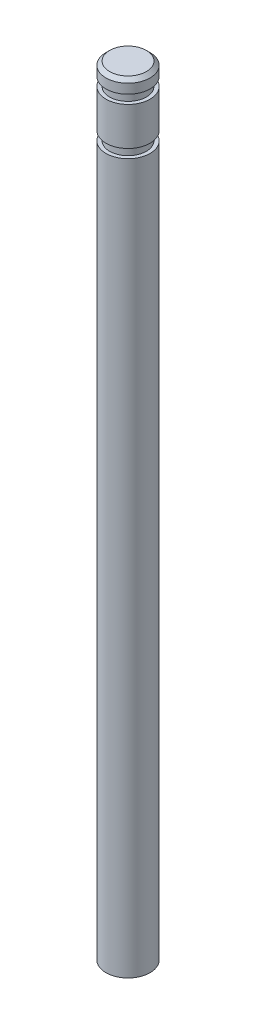
ISO-10303-21;
HEADER;
FILE_DESCRIPTION(('STEP AP214'),'2;1');
FILE_NAME('part.step','',(''),(''),'','','');
FILE_SCHEMA(('AUTOMOTIVE_DESIGN { 1 0 10303 214 1 1 1 1 }'));
ENDSEC;
DATA;
#1=APPLICATION_CONTEXT('core data for automotive mechanical design processes');
#2=APPLICATION_PROTOCOL_DEFINITION('international standard','automotive_design',2000,#1);
#3=PRODUCT_CONTEXT('',#1,'mechanical');
#4=PRODUCT('Part','Part','',(#3));
#5=PRODUCT_RELATED_PRODUCT_CATEGORY('part','',(#4));
#6=PRODUCT_DEFINITION_FORMATION('','',#4);
#7=PRODUCT_DEFINITION_CONTEXT('part definition',#1,'design');
#8=PRODUCT_DEFINITION('design','',#6,#7);
#9=PRODUCT_DEFINITION_SHAPE('','',#8);
#10=(LENGTH_UNIT() NAMED_UNIT(*) SI_UNIT(.MILLI.,.METRE.));
#11=(NAMED_UNIT(*) PLANE_ANGLE_UNIT() SI_UNIT($,.RADIAN.));
#12=(NAMED_UNIT(*) SI_UNIT($,.STERADIAN.) SOLID_ANGLE_UNIT());
#13=UNCERTAINTY_MEASURE_WITH_UNIT(LENGTH_MEASURE(1.E-05),#10,'distance_accuracy_value','');
#14=(GEOMETRIC_REPRESENTATION_CONTEXT(3) GLOBAL_UNCERTAINTY_ASSIGNED_CONTEXT((#13)) GLOBAL_UNIT_ASSIGNED_CONTEXT((#10,
#11,#12)) REPRESENTATION_CONTEXT('',''));
#15=CARTESIAN_POINT('',(0.,0.,0.));
#16=DIRECTION('',(0.,0.,1.));
#17=DIRECTION('',(1.,0.,0.));
#18=AXIS2_PLACEMENT_3D('',#15,#16,#17);
#19=CARTESIAN_POINT('',(0.,53.,0.));
#20=DIRECTION('',(0.,-1.,0.));
#21=DIRECTION('',(0.,0.,-1.));
#22=AXIS2_PLACEMENT_3D('',#19,#20,#21);
#23=CYLINDRICAL_SURFACE('',#22,1.5);
#24=CARTESIAN_POINT('',(0.,48.9,0.));
#25=DIRECTION('',(0.,-1.,0.));
#26=DIRECTION('',(0.,0.,-1.));
#27=AXIS2_PLACEMENT_3D('',#24,#25,#26);
#28=CIRCLE('',#27,1.5);
#29=CARTESIAN_POINT('',(0.,48.9,-1.5));
#30=VERTEX_POINT('',#29);
#31=EDGE_CURVE('E52',#30,#30,#28,.T.);
#32=ORIENTED_EDGE('',*,*,#31,.F.);
#33=EDGE_LOOP('',(#32));
#34=FACE_BOUND('',#33,.T.);
#35=CARTESIAN_POINT('',(0.,51.5,0.));
#36=DIRECTION('',(0.,-1.,0.));
#37=DIRECTION('',(0.,0.,-1.));
#38=AXIS2_PLACEMENT_3D('',#35,#36,#37);
#39=CIRCLE('',#38,1.5);
#40=CARTESIAN_POINT('',(0.,51.5,-1.5));
#41=VERTEX_POINT('',#40);
#42=EDGE_CURVE('E29',#41,#41,#39,.T.);
#43=ORIENTED_EDGE('',*,*,#42,.T.);
#44=EDGE_LOOP('',(#43));
#45=FACE_BOUND('',#44,.T.);
#46=ADVANCED_FACE('F14',(#34,#45),#23,.T.);
#47=CARTESIAN_POINT('',(1.5,51.5,0.));
#48=DIRECTION('',(0.,-1.,0.));
#49=DIRECTION('',(0.,0.,-1.));
#50=AXIS2_PLACEMENT_3D('',#47,#48,#49);
#51=PLANE('',#50);
#52=ORIENTED_EDGE('',*,*,#42,.F.);
#53=EDGE_LOOP('',(#52));
#54=FACE_BOUND('',#53,.T.);
#55=CARTESIAN_POINT('',(0.,51.5,0.));
#56=DIRECTION('',(0.,-1.,0.));
#57=DIRECTION('',(0.,0.,-1.));
#58=AXIS2_PLACEMENT_3D('',#55,#56,#57);
#59=CIRCLE('',#58,1.25);
#60=CARTESIAN_POINT('',(0.,51.5,-1.25));
#61=VERTEX_POINT('',#60);
#62=EDGE_CURVE('E34',#61,#61,#59,.T.);
#63=ORIENTED_EDGE('',*,*,#62,.T.);
#64=EDGE_LOOP('',(#63));
#65=FACE_BOUND('',#64,.T.);
#66=ADVANCED_FACE('F60',(#54,#65),#51,.F.);
#67=CARTESIAN_POINT('',(0.,0.,0.));
#68=DIRECTION('',(0.,-1.,0.));
#69=DIRECTION('',(0.,0.,-1.));
#70=AXIS2_PLACEMENT_3D('',#67,#68,#69);
#71=CYLINDRICAL_SURFACE('',#70,1.25);
#72=ORIENTED_EDGE('',*,*,#62,.F.);
#73=EDGE_LOOP('',(#72));
#74=FACE_BOUND('',#73,.T.);
#75=CARTESIAN_POINT('',(0.,52.1,0.));
#76=DIRECTION('',(0.,-1.,0.));
#77=DIRECTION('',(0.,0.,-1.));
#78=AXIS2_PLACEMENT_3D('',#75,#76,#77);
#79=CIRCLE('',#78,1.25);
#80=CARTESIAN_POINT('',(0.,52.1,-1.25));
#81=VERTEX_POINT('',#80);
#82=EDGE_CURVE('E37',#81,#81,#79,.T.);
#83=ORIENTED_EDGE('',*,*,#82,.T.);
#84=EDGE_LOOP('',(#83));
#85=FACE_BOUND('',#84,.T.);
#86=ADVANCED_FACE('F67',(#74,#85),#71,.T.);
#87=CARTESIAN_POINT('',(1.5,52.1,0.));
#88=DIRECTION('',(0.,1.,0.));
#89=DIRECTION('',(0.,0.,1.));
#90=AXIS2_PLACEMENT_3D('',#87,#88,#89);
#91=PLANE('',#90);
#92=ORIENTED_EDGE('',*,*,#82,.F.);
#93=EDGE_LOOP('',(#92));
#94=FACE_BOUND('',#93,.T.);
#95=CARTESIAN_POINT('',(0.,52.1,0.));
#96=DIRECTION('',(0.,-1.,0.));
#97=DIRECTION('',(0.,0.,-1.));
#98=AXIS2_PLACEMENT_3D('',#95,#96,#97);
#99=CIRCLE('',#98,1.5);
#100=CARTESIAN_POINT('',(0.,52.1,-1.5));
#101=VERTEX_POINT('',#100);
#102=EDGE_CURVE('E40',#101,#101,#99,.T.);
#103=ORIENTED_EDGE('',*,*,#102,.T.);
#104=EDGE_LOOP('',(#103));
#105=FACE_BOUND('',#104,.T.);
#106=ADVANCED_FACE('F73',(#94,#105),#91,.F.);
#107=CARTESIAN_POINT('',(0.,53.,0.));
#108=DIRECTION('',(0.,1.,0.));
#109=DIRECTION('',(0.,0.,1.));
#110=AXIS2_PLACEMENT_3D('',#107,#108,#109);
#111=PLANE('',#110);
#112=CARTESIAN_POINT('',(0.,53.,0.));
#113=DIRECTION('',(0.,1.,0.));
#114=DIRECTION('',(0.,0.,1.));
#115=AXIS2_PLACEMENT_3D('',#112,#113,#114);
#116=CIRCLE('',#115,1.25);
#117=CARTESIAN_POINT('',(0.,53.,1.25));
#118=VERTEX_POINT('',#117);
#119=EDGE_CURVE('E21',#118,#118,#116,.T.);
#120=ORIENTED_EDGE('',*,*,#119,.T.);
#121=EDGE_LOOP('',(#120));
#122=FACE_BOUND('',#121,.T.);
#123=ADVANCED_FACE('F79',(#122),#111,.T.);
#124=CARTESIAN_POINT('',(0.,52.75,0.));
#125=DIRECTION('',(0.,1.,0.));
#126=DIRECTION('',(0.,0.,1.));
#127=AXIS2_PLACEMENT_3D('',#124,#125,#126);
#128=CIRCLE('',#127,1.5);
#129=CARTESIAN_POINT('',(0.,52.75,1.5));
#130=VERTEX_POINT('',#129);
#131=EDGE_CURVE('E10',#130,#130,#128,.F.);
#132=ORIENTED_EDGE('',*,*,#131,.T.);
#133=EDGE_LOOP('',(#132));
#134=FACE_BOUND('',#133,.T.);
#135=ORIENTED_EDGE('',*,*,#102,.F.);
#136=EDGE_LOOP('',(#135));
#137=FACE_BOUND('',#136,.T.);
#138=ADVANCED_FACE('F61',(#134,#137),#23,.T.);
#139=CARTESIAN_POINT('',(1.5,48.3,0.));
#140=DIRECTION('',(0.,-1.,0.));
#141=DIRECTION('',(0.,0.,-1.));
#142=AXIS2_PLACEMENT_3D('',#139,#140,#141);
#143=PLANE('',#142);
#144=CARTESIAN_POINT('',(0.,48.3,0.));
#145=DIRECTION('',(0.,-1.,0.));
#146=DIRECTION('',(0.,0.,-1.));
#147=AXIS2_PLACEMENT_3D('',#144,#145,#146);
#148=CIRCLE('',#147,1.5);
#149=CARTESIAN_POINT('',(0.,48.3,-1.5));
#150=VERTEX_POINT('',#149);
#151=EDGE_CURVE('E43',#150,#150,#148,.T.);
#152=ORIENTED_EDGE('',*,*,#151,.F.);
#153=EDGE_LOOP('',(#152));
#154=FACE_BOUND('',#153,.T.);
#155=CARTESIAN_POINT('',(0.,48.3,0.));
#156=DIRECTION('',(0.,-1.,0.));
#157=DIRECTION('',(0.,0.,-1.));
#158=AXIS2_PLACEMENT_3D('',#155,#156,#157);
#159=CIRCLE('',#158,1.25);
#160=CARTESIAN_POINT('',(0.,48.3,-1.25));
#161=VERTEX_POINT('',#160);
#162=EDGE_CURVE('E46',#161,#161,#159,.T.);
#163=ORIENTED_EDGE('',*,*,#162,.T.);
#164=EDGE_LOOP('',(#163));
#165=FACE_BOUND('',#164,.T.);
#166=ADVANCED_FACE('F84',(#154,#165),#143,.F.);
#167=CARTESIAN_POINT('',(0.,0.,0.));
#168=DIRECTION('',(0.,-1.,0.));
#169=DIRECTION('',(0.,0.,-1.));
#170=AXIS2_PLACEMENT_3D('',#167,#168,#169);
#171=CYLINDRICAL_SURFACE('',#170,1.25);
#172=ORIENTED_EDGE('',*,*,#162,.F.);
#173=EDGE_LOOP('',(#172));
#174=FACE_BOUND('',#173,.T.);
#175=CARTESIAN_POINT('',(0.,48.9,0.));
#176=DIRECTION('',(0.,-1.,0.));
#177=DIRECTION('',(0.,0.,-1.));
#178=AXIS2_PLACEMENT_3D('',#175,#176,#177);
#179=CIRCLE('',#178,1.25);
#180=CARTESIAN_POINT('',(0.,48.9,-1.25));
#181=VERTEX_POINT('',#180);
#182=EDGE_CURVE('E49',#181,#181,#179,.T.);
#183=ORIENTED_EDGE('',*,*,#182,.T.);
#184=EDGE_LOOP('',(#183));
#185=FACE_BOUND('',#184,.T.);
#186=ADVANCED_FACE('F90',(#174,#185),#171,.T.);
#187=CARTESIAN_POINT('',(1.5,48.9,0.));
#188=DIRECTION('',(0.,1.,0.));
#189=DIRECTION('',(0.,0.,1.));
#190=AXIS2_PLACEMENT_3D('',#187,#188,#189);
#191=PLANE('',#190);
#192=ORIENTED_EDGE('',*,*,#182,.F.);
#193=EDGE_LOOP('',(#192));
#194=FACE_BOUND('',#193,.T.);
#195=ORIENTED_EDGE('',*,*,#31,.T.);
#196=EDGE_LOOP('',(#195));
#197=FACE_BOUND('',#196,.T.);
#198=ADVANCED_FACE('F56',(#194,#197),#191,.F.);
#199=CARTESIAN_POINT('',(0.,0.,0.));
#200=DIRECTION('',(0.,1.,0.));
#201=DIRECTION('',(0.,0.,1.));
#202=AXIS2_PLACEMENT_3D('',#199,#200,#201);
#203=PLANE('',#202);
#204=CARTESIAN_POINT('',(0.,0.,0.));
#205=DIRECTION('',(0.,1.,0.));
#206=DIRECTION('',(0.,0.,1.));
#207=AXIS2_PLACEMENT_3D('',#204,#205,#206);
#208=CIRCLE('',#207,1.5);
#209=CARTESIAN_POINT('',(0.,0.,1.5));
#210=VERTEX_POINT('',#209);
#211=EDGE_CURVE('E25',#210,#210,#208,.T.);
#212=ORIENTED_EDGE('',*,*,#211,.F.);
#213=EDGE_LOOP('',(#212));
#214=FACE_BOUND('',#213,.T.);
#215=ADVANCED_FACE('F96',(#214),#203,.F.);
#216=ORIENTED_EDGE('',*,*,#151,.T.);
#217=EDGE_LOOP('',(#216));
#218=FACE_BOUND('',#217,.T.);
#219=ORIENTED_EDGE('',*,*,#211,.T.);
#220=EDGE_LOOP('',(#219));
#221=FACE_BOUND('',#220,.T.);
#222=ADVANCED_FACE('F62',(#218,#221),#23,.T.);
#223=CARTESIAN_POINT('',(0.,53.,0.));
#224=DIRECTION('',(0.,-1.,0.));
#225=DIRECTION('',(0.,0.,-1.));
#226=AXIS2_PLACEMENT_3D('',#223,#224,#225);
#227=CONICAL_SURFACE('',#226,1.25,0.785398163397448);
#228=ORIENTED_EDGE('',*,*,#131,.F.);
#229=EDGE_LOOP('',(#228));
#230=FACE_BOUND('',#229,.T.);
#231=ORIENTED_EDGE('',*,*,#119,.F.);
#232=EDGE_LOOP('',(#231));
#233=FACE_BOUND('',#232,.T.);
#234=ADVANCED_FACE('F16',(#230,#233),#227,.T.);
#235=CLOSED_SHELL('',(#46,#66,#86,#106,#123,#138,#166,#186,#198,#215,#222,#234));
#236=MANIFOLD_SOLID_BREP('B1',#235);
#237=ADVANCED_BREP_SHAPE_REPRESENTATION('',(#18,#236),#14);
#238=SHAPE_DEFINITION_REPRESENTATION(#9,#237);
ENDSEC;
END-ISO-10303-21;
